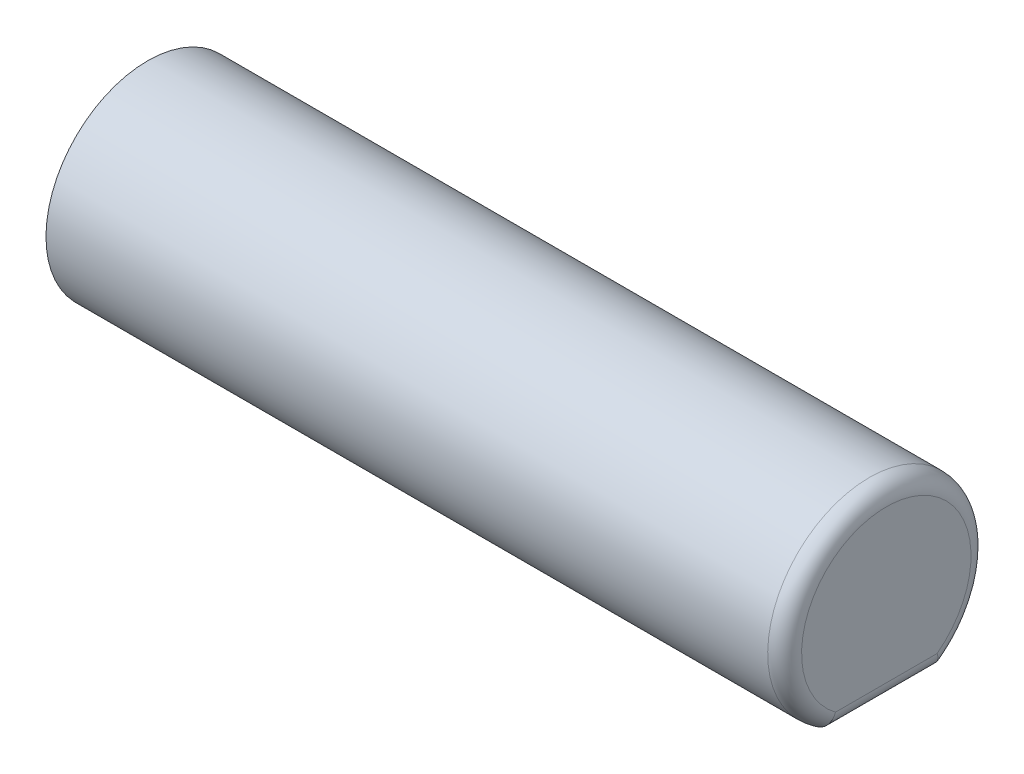
ISO-10303-21;
HEADER;
FILE_DESCRIPTION(('STEP AP214'),'2;1');
FILE_NAME('part.step','',(''),(''),'','','');
FILE_SCHEMA(('AUTOMOTIVE_DESIGN { 1 0 10303 214 1 1 1 1 }'));
ENDSEC;
DATA;
#1=APPLICATION_CONTEXT('core data for automotive mechanical design processes');
#2=APPLICATION_PROTOCOL_DEFINITION('international standard','automotive_design',2000,#1);
#3=PRODUCT_CONTEXT('',#1,'mechanical');
#4=PRODUCT('Part','Part','',(#3));
#5=PRODUCT_RELATED_PRODUCT_CATEGORY('part','',(#4));
#6=PRODUCT_DEFINITION_FORMATION('','',#4);
#7=PRODUCT_DEFINITION_CONTEXT('part definition',#1,'design');
#8=PRODUCT_DEFINITION('design','',#6,#7);
#9=PRODUCT_DEFINITION_SHAPE('','',#8);
#10=(LENGTH_UNIT() NAMED_UNIT(*) SI_UNIT(.MILLI.,.METRE.));
#11=(NAMED_UNIT(*) PLANE_ANGLE_UNIT() SI_UNIT($,.RADIAN.));
#12=(NAMED_UNIT(*) SI_UNIT($,.STERADIAN.) SOLID_ANGLE_UNIT());
#13=UNCERTAINTY_MEASURE_WITH_UNIT(LENGTH_MEASURE(1.E-05),#10,'distance_accuracy_value','');
#14=(GEOMETRIC_REPRESENTATION_CONTEXT(3) GLOBAL_UNCERTAINTY_ASSIGNED_CONTEXT((#13)) GLOBAL_UNIT_ASSIGNED_CONTEXT((#10,
#11,#12)) REPRESENTATION_CONTEXT('',''));
#15=CARTESIAN_POINT('',(0.,0.,0.));
#16=DIRECTION('',(0.,0.,1.));
#17=DIRECTION('',(1.,0.,0.));
#18=AXIS2_PLACEMENT_3D('',#15,#16,#17);
#19=CARTESIAN_POINT('',(21.8,0.,0.));
#20=DIRECTION('',(-1.,0.,0.));
#21=DIRECTION('',(0.,0.,1.));
#22=AXIS2_PLACEMENT_3D('',#19,#20,#21);
#23=CYLINDRICAL_SURFACE('',#22,3.);
#24=DIRECTION('',(1.,0.,0.));
#25=VECTOR('',#24,1.);
#26=CARTESIAN_POINT('',(9.8,-2.5,1.6583123951777));
#27=LINE('',#26,#25);
#28=CARTESIAN_POINT('',(9.8,-2.5,1.6583123951777));
#29=VERTEX_POINT('',#28);
#30=CARTESIAN_POINT('',(21.3,-2.5,1.6583123951777));
#31=VERTEX_POINT('',#30);
#32=EDGE_CURVE('E79',#29,#31,#27,.T.);
#33=ORIENTED_EDGE('',*,*,#32,.T.);
#34=CARTESIAN_POINT('',(21.3,0.,0.));
#35=DIRECTION('',(1.,0.,0.));
#36=DIRECTION('',(0.,0.,-1.));
#37=AXIS2_PLACEMENT_3D('',#34,#35,#36);
#38=CIRCLE('',#37,3.);
#39=CARTESIAN_POINT('',(21.3,-2.5,-1.6583123951777));
#40=VERTEX_POINT('',#39);
#41=EDGE_CURVE('E46',#31,#40,#38,.F.);
#42=ORIENTED_EDGE('',*,*,#41,.T.);
#43=DIRECTION('',(1.,0.,0.));
#44=VECTOR('',#43,1.);
#45=CARTESIAN_POINT('',(9.8,-2.5,-1.6583123951777));
#46=LINE('',#45,#44);
#47=CARTESIAN_POINT('',(9.8,-2.5,-1.6583123951777));
#48=VERTEX_POINT('',#47);
#49=EDGE_CURVE('E83',#48,#40,#46,.T.);
#50=ORIENTED_EDGE('',*,*,#49,.F.);
#51=CARTESIAN_POINT('',(9.8,0.,0.));
#52=DIRECTION('',(1.,0.,0.));
#53=DIRECTION('',(0.,0.,-1.));
#54=AXIS2_PLACEMENT_3D('',#51,#52,#53);
#55=CIRCLE('',#54,3.);
#56=EDGE_CURVE('E76',#29,#48,#55,.T.);
#57=ORIENTED_EDGE('',*,*,#56,.F.);
#58=EDGE_LOOP('',(#33,#42,#50,#57));
#59=FACE_BOUND('',#58,.T.);
#60=CARTESIAN_POINT('',(0.,0.,0.));
#61=DIRECTION('',(1.,0.,0.));
#62=DIRECTION('',(0.,0.,-1.));
#63=AXIS2_PLACEMENT_3D('',#60,#61,#62);
#64=CIRCLE('',#63,3.);
#65=CARTESIAN_POINT('',(0.,0.,-3.));
#66=VERTEX_POINT('',#65);
#67=EDGE_CURVE('E88',#66,#66,#64,.T.);
#68=ORIENTED_EDGE('',*,*,#67,.T.);
#69=EDGE_LOOP('',(#68));
#70=FACE_BOUND('',#69,.T.);
#71=ADVANCED_FACE('F33',(#59,#70),#23,.T.);
#72=CARTESIAN_POINT('',(21.8,0.,0.));
#73=DIRECTION('',(1.,0.,0.));
#74=DIRECTION('',(0.,0.,-1.));
#75=AXIS2_PLACEMENT_3D('',#72,#73,#74);
#76=PLANE('',#75);
#77=DIRECTION('',(0.,0.,1.));
#78=VECTOR('',#77,1.);
#79=CARTESIAN_POINT('',(21.8,-2.,-1.6583123951777));
#80=LINE('',#79,#78);
#81=CARTESIAN_POINT('',(21.8,-2.,1.5));
#82=VERTEX_POINT('',#81);
#83=CARTESIAN_POINT('',(21.8,-2.,-1.5));
#84=VERTEX_POINT('',#83);
#85=EDGE_CURVE('E92',#82,#84,#80,.F.);
#86=ORIENTED_EDGE('',*,*,#85,.T.);
#87=CARTESIAN_POINT('',(21.8,0.,0.));
#88=DIRECTION('',(1.,0.,0.));
#89=DIRECTION('',(0.,0.,-1.));
#90=AXIS2_PLACEMENT_3D('',#87,#88,#89);
#91=CIRCLE('',#90,2.5);
#92=EDGE_CURVE('E94',#84,#82,#91,.T.);
#93=ORIENTED_EDGE('',*,*,#92,.T.);
#94=EDGE_LOOP('',(#86,#93));
#95=FACE_BOUND('',#94,.T.);
#96=ADVANCED_FACE('F108',(#95),#76,.T.);
#97=CARTESIAN_POINT('',(0.,0.,0.));
#98=DIRECTION('',(1.,0.,0.));
#99=DIRECTION('',(0.,0.,-1.));
#100=AXIS2_PLACEMENT_3D('',#97,#98,#99);
#101=PLANE('',#100);
#102=ORIENTED_EDGE('',*,*,#67,.F.);
#103=EDGE_LOOP('',(#102));
#104=FACE_BOUND('',#103,.T.);
#105=ADVANCED_FACE('F109',(#104),#101,.F.);
#106=CARTESIAN_POINT('',(9.8,-2.5,0.));
#107=DIRECTION('',(0.,1.,0.));
#108=DIRECTION('',(0.,0.,1.));
#109=AXIS2_PLACEMENT_3D('',#106,#107,#108);
#110=PLANE('',#109);
#111=ORIENTED_EDGE('',*,*,#49,.T.);
#112=DIRECTION('',(0.,0.,1.));
#113=VECTOR('',#112,1.);
#114=CARTESIAN_POINT('',(21.3,-2.5,1.6583123951777));
#115=LINE('',#114,#113);
#116=EDGE_CURVE('E11',#40,#31,#115,.T.);
#117=ORIENTED_EDGE('',*,*,#116,.T.);
#118=ORIENTED_EDGE('',*,*,#32,.F.);
#119=DIRECTION('',(0.,0.,1.));
#120=VECTOR('',#119,1.);
#121=CARTESIAN_POINT('',(9.8,-2.5,0.));
#122=LINE('',#121,#120);
#123=EDGE_CURVE('E73',#48,#29,#122,.T.);
#124=ORIENTED_EDGE('',*,*,#123,.F.);
#125=EDGE_LOOP('',(#111,#117,#118,#124));
#126=FACE_BOUND('',#125,.T.);
#127=ADVANCED_FACE('F80',(#126),#110,.F.);
#128=CARTESIAN_POINT('',(9.8,0.,0.));
#129=DIRECTION('',(1.,0.,0.));
#130=DIRECTION('',(0.,0.,-1.));
#131=AXIS2_PLACEMENT_3D('',#128,#129,#130);
#132=PLANE('',#131);
#133=ORIENTED_EDGE('',*,*,#123,.T.);
#134=ORIENTED_EDGE('',*,*,#56,.T.);
#135=EDGE_LOOP('',(#133,#134));
#136=FACE_BOUND('',#135,.T.);
#137=ADVANCED_FACE('F74',(#136),#132,.T.);
#138=CARTESIAN_POINT('',(21.3,-2.,0.));
#139=DIRECTION('',(0.,0.,-1.));
#140=DIRECTION('',(-1.,0.,0.));
#141=AXIS2_PLACEMENT_3D('',#138,#139,#140);
#142=CYLINDRICAL_SURFACE('',#141,0.5);
#143=CARTESIAN_POINT('',(21.3,-2.5,1.6583123951777));
#144=CARTESIAN_POINT('',(21.3272422987405,-2.50002760722823,1.65831909401846));
#145=CARTESIAN_POINT('',(21.3544710112833,-2.49777539464988,1.65764162673097));
#146=CARTESIAN_POINT('',(21.4080958468544,-2.4889221512901,1.65496989599058));
#147=CARTESIAN_POINT('',(21.4344934162729,-2.48232916930232,1.65297806964896));
#148=CARTESIAN_POINT('',(21.4857591941927,-2.46500301419001,1.64772857695035));
#149=CARTESIAN_POINT('',(21.5106272638976,-2.45426946596515,1.64447079590835));
#150=CARTESIAN_POINT('',(21.5581710386937,-2.42903577654813,1.63678056404647));
#151=CARTESIAN_POINT('',(21.5808465532688,-2.41453530844285,1.63234801127303));
#152=CARTESIAN_POINT('',(21.6238042832416,-2.38195548189256,1.62233808490316));
#153=CARTESIAN_POINT('',(21.6440391159584,-2.36381933320303,1.61674248534148));
#154=CARTESIAN_POINT('',(21.6811894196707,-2.3246888884638,1.60459519383948));
#155=CARTESIAN_POINT('',(21.6981037957745,-2.30369365350745,1.59804318777));
#156=CARTESIAN_POINT('',(21.7288656407522,-2.25855428198764,1.5838581221772));
#157=CARTESIAN_POINT('',(21.7425609555039,-2.23431698692732,1.57619200205638));
#158=CARTESIAN_POINT('',(21.7656940632165,-2.18410005508651,1.560180757041));
#159=CARTESIAN_POINT('',(21.7751322562237,-2.15812058228401,1.55183569603429));
#160=CARTESIAN_POINT('',(21.7879922887024,-2.11100299862337,1.53657015083966));
#161=CARTESIAN_POINT('',(21.7922832176411,-2.09006541993643,1.5297429649853));
#162=CARTESIAN_POINT('',(21.7981533554476,-2.04790341246735,1.51589944104315));
#163=CARTESIAN_POINT('',(21.7997374562583,-2.02667957117988,1.50888346751194));
#164=CARTESIAN_POINT('',(21.7999900232254,-2.00365150464484,1.50121680012523));
#165=CARTESIAN_POINT('',(21.8000000254336,-2.00182561266575,1.50060854018106));
#166=CARTESIAN_POINT('',(21.8,-2.,1.5));
#167=B_SPLINE_CURVE_WITH_KNOTS('',3,(#143,#144,#145,#146,#147,#148,#149,#150,#151,#152,#153,
#154,#155,#156,#157,#158,#159,#160,#161,#162,#163,#164,#165,#166),.UNSPECIFIED.,.F.,.F.,(4,2,2,
2,2,2,2,2,2,2,2,4),(0.,0.0816048702020474,0.163058850584472,0.24452021174339,0.325988644911101,
0.408845731531545,0.49173009383184,0.577975018960512,0.664211837869942,0.731369438184101,
0.7984055383579,0.804179119111204),.UNSPECIFIED.);
#168=EDGE_CURVE('E97',#31,#82,#167,.T.);
#169=ORIENTED_EDGE('',*,*,#168,.F.);
#170=ORIENTED_EDGE('',*,*,#116,.F.);
#171=CARTESIAN_POINT('',(21.3,-2.5,-1.6583123951777));
#172=CARTESIAN_POINT('',(21.3272422987405,-2.50002760722823,-1.65831909401846));
#173=CARTESIAN_POINT('',(21.3544710112833,-2.49777539464988,-1.65764162673097));
#174=CARTESIAN_POINT('',(21.4080958468544,-2.4889221512901,-1.65496989599058));
#175=CARTESIAN_POINT('',(21.4344934162729,-2.48232916930231,-1.65297806964896));
#176=CARTESIAN_POINT('',(21.4857591941927,-2.46500301419001,-1.64772857695034));
#177=CARTESIAN_POINT('',(21.5106272638976,-2.45426946596515,-1.64447079590835));
#178=CARTESIAN_POINT('',(21.5581710386937,-2.42903577654813,-1.63678056404647));
#179=CARTESIAN_POINT('',(21.5808465532688,-2.41453530844285,-1.63234801127303));
#180=CARTESIAN_POINT('',(21.6238042832416,-2.38195548189256,-1.62233808490316));
#181=CARTESIAN_POINT('',(21.6440391159584,-2.36381933320303,-1.61674248534148));
#182=CARTESIAN_POINT('',(21.6811894196707,-2.3246888884638,-1.60459519383948));
#183=CARTESIAN_POINT('',(21.6981037957745,-2.30369365350745,-1.59804318777));
#184=CARTESIAN_POINT('',(21.7288656407522,-2.25855428198764,-1.5838581221772));
#185=CARTESIAN_POINT('',(21.7425609555039,-2.23431698692732,-1.57619200205639));
#186=CARTESIAN_POINT('',(21.7656940632165,-2.18410005508651,-1.560180757041));
#187=CARTESIAN_POINT('',(21.7751322562237,-2.15812058228401,-1.55183569603429));
#188=CARTESIAN_POINT('',(21.7879922887024,-2.11100299862337,-1.53657015083966));
#189=CARTESIAN_POINT('',(21.7922832176411,-2.09006541993643,-1.5297429649853));
#190=CARTESIAN_POINT('',(21.7981533554476,-2.04790341246735,-1.51589944104315));
#191=CARTESIAN_POINT('',(21.7997374562583,-2.02667957117988,-1.50888346751194));
#192=CARTESIAN_POINT('',(21.7999900232254,-2.00365150464484,-1.50121680012523));
#193=CARTESIAN_POINT('',(21.8000000254336,-2.00182561266575,-1.50060854018106));
#194=CARTESIAN_POINT('',(21.8,-2.,-1.5));
#195=B_SPLINE_CURVE_WITH_KNOTS('',3,(#171,#172,#173,#174,#175,#176,#177,#178,#179,#180,#181,
#182,#183,#184,#185,#186,#187,#188,#189,#190,#191,#192,#193,#194),.UNSPECIFIED.,.F.,.F.,(4,2,2,
2,2,2,2,2,2,2,2,4),(0.,0.0816048702020508,0.163058850584472,0.244520211743391,0.325988644911101,
0.408845731531544,0.49173009383184,0.577975018960512,0.664211837869943,0.731369438184102,
0.7984055383579,0.804179119111204),.UNSPECIFIED.);
#196=EDGE_CURVE('E38',#84,#40,#195,.F.);
#197=ORIENTED_EDGE('',*,*,#196,.F.);
#198=ORIENTED_EDGE('',*,*,#85,.F.);
#199=EDGE_LOOP('',(#169,#170,#197,#198));
#200=FACE_BOUND('',#199,.T.);
#201=ADVANCED_FACE('F35',(#200),#142,.T.);
#202=CARTESIAN_POINT('',(21.3,0.,0.));
#203=DIRECTION('',(1.,0.,0.));
#204=DIRECTION('',(0.,0.,-1.));
#205=AXIS2_PLACEMENT_3D('',#202,#203,#204);
#206=TOROIDAL_SURFACE('',#205,2.5,0.5);
#207=ORIENTED_EDGE('',*,*,#196,.T.);
#208=ORIENTED_EDGE('',*,*,#41,.F.);
#209=ORIENTED_EDGE('',*,*,#168,.T.);
#210=ORIENTED_EDGE('',*,*,#92,.F.);
#211=EDGE_LOOP('',(#207,#208,#209,#210));
#212=FACE_BOUND('',#211,.T.);
#213=ADVANCED_FACE('F101',(#212),#206,.T.);
#214=CLOSED_SHELL('',(#71,#96,#105,#127,#137,#201,#213));
#215=MANIFOLD_SOLID_BREP('B2',#214);
#216=ADVANCED_BREP_SHAPE_REPRESENTATION('',(#18,#215),#14);
#217=SHAPE_DEFINITION_REPRESENTATION(#9,#216);
ENDSEC;
END-ISO-10303-21;
